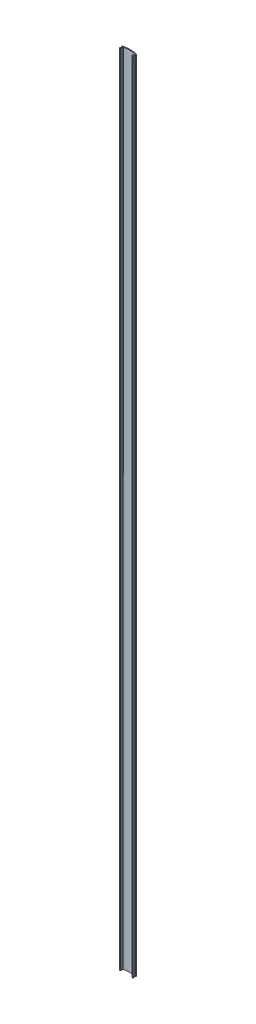
ISO-10303-21;
HEADER;
FILE_DESCRIPTION(('STEP AP214'),'2;1');
FILE_NAME('part.step','',(''),(''),'','','');
FILE_SCHEMA(('AUTOMOTIVE_DESIGN { 1 0 10303 214 1 1 1 1 }'));
ENDSEC;
DATA;
#1=APPLICATION_CONTEXT('core data for automotive mechanical design processes');
#2=APPLICATION_PROTOCOL_DEFINITION('international standard','automotive_design',2000,#1);
#3=PRODUCT_CONTEXT('',#1,'mechanical');
#4=PRODUCT('Part','Part','',(#3));
#5=PRODUCT_RELATED_PRODUCT_CATEGORY('part','',(#4));
#6=PRODUCT_DEFINITION_FORMATION('','',#4);
#7=PRODUCT_DEFINITION_CONTEXT('part definition',#1,'design');
#8=PRODUCT_DEFINITION('design','',#6,#7);
#9=PRODUCT_DEFINITION_SHAPE('','',#8);
#10=(LENGTH_UNIT() NAMED_UNIT(*) SI_UNIT(.MILLI.,.METRE.));
#11=(NAMED_UNIT(*) PLANE_ANGLE_UNIT() SI_UNIT($,.RADIAN.));
#12=(NAMED_UNIT(*) SI_UNIT($,.STERADIAN.) SOLID_ANGLE_UNIT());
#13=UNCERTAINTY_MEASURE_WITH_UNIT(LENGTH_MEASURE(1.E-05),#10,'distance_accuracy_value','');
#14=(GEOMETRIC_REPRESENTATION_CONTEXT(3) GLOBAL_UNCERTAINTY_ASSIGNED_CONTEXT((#13)) GLOBAL_UNIT_ASSIGNED_CONTEXT((#10,
#11,#12)) REPRESENTATION_CONTEXT('',''));
#15=CARTESIAN_POINT('',(0.,0.,0.));
#16=DIRECTION('',(0.,0.,1.));
#17=DIRECTION('',(1.,0.,0.));
#18=AXIS2_PLACEMENT_3D('',#15,#16,#17);
#19=CARTESIAN_POINT('',(-27.5846189597314,920.,-1.06516589667228));
#20=DIRECTION('',(0.,-1.,0.));
#21=DIRECTION('',(0.,0.,-1.));
#22=AXIS2_PLACEMENT_3D('',#19,#20,#21);
#23=CYLINDRICAL_SURFACE('',#22,0.299999999999996);
#24=CARTESIAN_POINT('',(-27.5846189597314,0.,-1.06516589667228));
#25=DIRECTION('',(0.,1.,0.));
#26=DIRECTION('',(0.,0.,1.));
#27=AXIS2_PLACEMENT_3D('',#24,#25,#26);
#28=CIRCLE('',#27,0.299999999999996);
#29=CARTESIAN_POINT('',(-27.8844231170864,0.,-1.05432766652717));
#30=VERTEX_POINT('',#29);
#31=CARTESIAN_POINT('',(-27.6471873404078,0.,-1.35856868762617));
#32=VERTEX_POINT('',#31);
#33=EDGE_CURVE('E222',#30,#32,#28,.F.);
#34=ORIENTED_EDGE('',*,*,#33,.F.);
#35=DIRECTION('',(0.,-1.,0.));
#36=VECTOR('',#35,1.);
#37=CARTESIAN_POINT('',(-27.8844231170864,920.,-1.05432766652717));
#38=LINE('',#37,#36);
#39=CARTESIAN_POINT('',(-27.8844231170864,920.,-1.05432766652717));
#40=VERTEX_POINT('',#39);
#41=EDGE_CURVE('E11',#40,#30,#38,.T.);
#42=ORIENTED_EDGE('',*,*,#41,.F.);
#43=CARTESIAN_POINT('',(-27.5846189597314,920.,-1.06516589667228));
#44=DIRECTION('',(0.,1.,0.));
#45=DIRECTION('',(0.,0.,1.));
#46=AXIS2_PLACEMENT_3D('',#43,#44,#45);
#47=CIRCLE('',#46,0.299999999999996);
#48=CARTESIAN_POINT('',(-27.6471873404078,920.,-1.35856868762617));
#49=VERTEX_POINT('',#48);
#50=EDGE_CURVE('E283',#40,#49,#47,.F.);
#51=ORIENTED_EDGE('',*,*,#50,.T.);
#52=DIRECTION('',(0.,-1.,0.));
#53=VECTOR('',#52,1.);
#54=CARTESIAN_POINT('',(-27.6471873404078,920.,-1.35856868762617));
#55=LINE('',#54,#53);
#56=EDGE_CURVE('E133',#49,#32,#55,.T.);
#57=ORIENTED_EDGE('',*,*,#56,.T.);
#58=EDGE_LOOP('',(#34,#42,#51,#57));
#59=FACE_BOUND('',#58,.T.);
#60=ADVANCED_FACE('F34',(#59),#23,.T.);
#61=CARTESIAN_POINT('',(-27.1597461180904,920.,-1.08052548901662));
#62=DIRECTION('',(0.,-1.,0.));
#63=DIRECTION('',(0.,0.,-1.));
#64=AXIS2_PLACEMENT_3D('',#61,#62,#63);
#65=CYLINDRICAL_SURFACE('',#64,0.725150383559832);
#66=CARTESIAN_POINT('',(-27.1597461180904,0.,-1.08052548901662));
#67=DIRECTION('',(0.,1.,0.));
#68=DIRECTION('',(0.,0.,1.));
#69=AXIS2_PLACEMENT_3D('',#66,#67,#68);
#70=CIRCLE('',#69,0.725150383559832);
#71=CARTESIAN_POINT('',(-27.263686116073,0.,-0.362862925135548));
#72=VERTEX_POINT('',#71);
#73=EDGE_CURVE('E225',#72,#30,#70,.F.);
#74=ORIENTED_EDGE('',*,*,#73,.F.);
#75=DIRECTION('',(0.,-1.,0.));
#76=VECTOR('',#75,1.);
#77=CARTESIAN_POINT('',(-27.263686116073,920.,-0.362862925135548));
#78=LINE('',#77,#76);
#79=CARTESIAN_POINT('',(-27.263686116073,920.,-0.362862925135548));
#80=VERTEX_POINT('',#79);
#81=EDGE_CURVE('E42',#80,#72,#78,.T.);
#82=ORIENTED_EDGE('',*,*,#81,.F.);
#83=CARTESIAN_POINT('',(-27.1597461180904,920.,-1.08052548901662));
#84=DIRECTION('',(0.,1.,0.));
#85=DIRECTION('',(0.,0.,1.));
#86=AXIS2_PLACEMENT_3D('',#83,#84,#85);
#87=CIRCLE('',#86,0.725150383559832);
#88=EDGE_CURVE('E343',#80,#40,#87,.F.);
#89=ORIENTED_EDGE('',*,*,#88,.T.);
#90=ORIENTED_EDGE('',*,*,#41,.T.);
#91=EDGE_LOOP('',(#74,#82,#89,#90));
#92=FACE_BOUND('',#91,.T.);
#93=ADVANCED_FACE('F342',(#92),#65,.T.);
#94=CARTESIAN_POINT('',(-27.3001584340567,920.,-0.111036700940236));
#95=DIRECTION('',(0.,-1.,0.));
#96=DIRECTION('',(0.,0.,-1.));
#97=AXIS2_PLACEMENT_3D('',#94,#95,#96);
#98=CYLINDRICAL_SURFACE('',#97,0.254453683745326);
#99=CARTESIAN_POINT('',(-27.3001584340567,0.,-0.111036700940236));
#100=DIRECTION('',(0.,1.,0.));
#101=DIRECTION('',(0.,0.,1.));
#102=AXIS2_PLACEMENT_3D('',#99,#100,#101);
#103=CIRCLE('',#102,0.254453683745326);
#104=CARTESIAN_POINT('',(-27.0457047503114,0.,-0.111036700940236));
#105=VERTEX_POINT('',#104);
#106=EDGE_CURVE('E228',#72,#105,#103,.F.);
#107=ORIENTED_EDGE('',*,*,#106,.T.);
#108=DIRECTION('',(0.,-1.,0.));
#109=VECTOR('',#108,1.);
#110=CARTESIAN_POINT('',(-27.0457047503114,920.,-0.111036700940236));
#111=LINE('',#110,#109);
#112=CARTESIAN_POINT('',(-27.0457047503114,920.,-0.111036700940236));
#113=VERTEX_POINT('',#112);
#114=EDGE_CURVE('E326',#113,#105,#111,.T.);
#115=ORIENTED_EDGE('',*,*,#114,.F.);
#116=CARTESIAN_POINT('',(-27.3001584340567,920.,-0.111036700940236));
#117=DIRECTION('',(0.,1.,0.));
#118=DIRECTION('',(0.,0.,1.));
#119=AXIS2_PLACEMENT_3D('',#116,#117,#118);
#120=CIRCLE('',#119,0.254453683745326);
#121=EDGE_CURVE('E333',#80,#113,#120,.F.);
#122=ORIENTED_EDGE('',*,*,#121,.F.);
#123=ORIENTED_EDGE('',*,*,#81,.T.);
#124=EDGE_LOOP('',(#107,#115,#122,#123));
#125=FACE_BOUND('',#124,.T.);
#126=ADVANCED_FACE('F331',(#125),#98,.F.);
#127=CARTESIAN_POINT('',(-27.0457047503114,920.,0.));
#128=DIRECTION('',(1.,0.,0.));
#129=DIRECTION('',(0.,0.,-1.));
#130=AXIS2_PLACEMENT_3D('',#127,#128,#129);
#131=PLANE('',#130);
#132=DIRECTION('',(0.,0.,1.));
#133=VECTOR('',#132,1.);
#134=CARTESIAN_POINT('',(-27.0457047503114,0.,0.));
#135=LINE('',#134,#133);
#136=CARTESIAN_POINT('',(-27.0457047503114,0.,0.970985399809798));
#137=VERTEX_POINT('',#136);
#138=EDGE_CURVE('E230',#105,#137,#135,.T.);
#139=ORIENTED_EDGE('',*,*,#138,.T.);
#140=DIRECTION('',(0.,-1.,0.));
#141=VECTOR('',#140,1.);
#142=CARTESIAN_POINT('',(-27.0457047503114,920.,0.970985399809798));
#143=LINE('',#142,#141);
#144=CARTESIAN_POINT('',(-27.0457047503114,920.,0.970985399809798));
#145=VERTEX_POINT('',#144);
#146=EDGE_CURVE('E323',#145,#137,#143,.T.);
#147=ORIENTED_EDGE('',*,*,#146,.F.);
#148=DIRECTION('',(0.,0.,1.));
#149=VECTOR('',#148,1.);
#150=CARTESIAN_POINT('',(-27.0457047503114,920.,0.));
#151=LINE('',#150,#149);
#152=EDGE_CURVE('E351',#113,#145,#151,.T.);
#153=ORIENTED_EDGE('',*,*,#152,.F.);
#154=ORIENTED_EDGE('',*,*,#114,.T.);
#155=EDGE_LOOP('',(#139,#147,#153,#154));
#156=FACE_BOUND('',#155,.T.);
#157=ADVANCED_FACE('F466',(#156),#131,.F.);
#158=CARTESIAN_POINT('',(-27.3001584340567,920.,0.970985399809798));
#159=DIRECTION('',(0.,-1.,0.));
#160=DIRECTION('',(0.,0.,-1.));
#161=AXIS2_PLACEMENT_3D('',#158,#159,#160);
#162=CYLINDRICAL_SURFACE('',#161,0.254453683745326);
#163=CARTESIAN_POINT('',(-27.3001584340567,0.,0.970985399809798));
#164=DIRECTION('',(0.,1.,0.));
#165=DIRECTION('',(0.,0.,1.));
#166=AXIS2_PLACEMENT_3D('',#163,#164,#165);
#167=CIRCLE('',#166,0.254453683745326);
#168=CARTESIAN_POINT('',(-27.260665215533,0.,1.22235557079715));
#169=VERTEX_POINT('',#168);
#170=EDGE_CURVE('E232',#137,#169,#167,.F.);
#171=ORIENTED_EDGE('',*,*,#170,.T.);
#172=DIRECTION('',(0.,-1.,0.));
#173=VECTOR('',#172,1.);
#174=CARTESIAN_POINT('',(-27.260665215533,920.,1.22235557079715));
#175=LINE('',#174,#173);
#176=CARTESIAN_POINT('',(-27.260665215533,920.,1.22235557079715));
#177=VERTEX_POINT('',#176);
#178=EDGE_CURVE('E320',#177,#169,#175,.T.);
#179=ORIENTED_EDGE('',*,*,#178,.F.);
#180=CARTESIAN_POINT('',(-27.3001584340567,920.,0.970985399809798));
#181=DIRECTION('',(0.,1.,0.));
#182=DIRECTION('',(0.,0.,1.));
#183=AXIS2_PLACEMENT_3D('',#180,#181,#182);
#184=CIRCLE('',#183,0.254453683745326);
#185=EDGE_CURVE('E353',#145,#177,#184,.F.);
#186=ORIENTED_EDGE('',*,*,#185,.F.);
#187=ORIENTED_EDGE('',*,*,#146,.T.);
#188=EDGE_LOOP('',(#171,#179,#186,#187));
#189=FACE_BOUND('',#188,.T.);
#190=ADVANCED_FACE('F461',(#189),#162,.F.);
#191=CARTESIAN_POINT('',(-27.183170486753,920.,1.71560134696434));
#192=DIRECTION('',(0.,-1.,0.));
#193=DIRECTION('',(0.,0.,-1.));
#194=AXIS2_PLACEMENT_3D('',#191,#192,#193);
#195=CYLINDRICAL_SURFACE('',#194,0.499296333548983);
#196=CARTESIAN_POINT('',(-27.183170486753,0.,1.71560134696434));
#197=DIRECTION('',(0.,1.,0.));
#198=DIRECTION('',(0.,0.,1.));
#199=AXIS2_PLACEMENT_3D('',#196,#197,#198);
#200=CIRCLE('',#199,0.499296333548983);
#201=CARTESIAN_POINT('',(-27.0709170540074,0.,2.20211547371944));
#202=VERTEX_POINT('',#201);
#203=EDGE_CURVE('E234',#169,#202,#200,.T.);
#204=ORIENTED_EDGE('',*,*,#203,.T.);
#205=DIRECTION('',(0.,-1.,0.));
#206=VECTOR('',#205,1.);
#207=CARTESIAN_POINT('',(-27.0709170540074,920.,2.20211547371944));
#208=LINE('',#207,#206);
#209=CARTESIAN_POINT('',(-27.0709170540074,920.,2.20211547371944));
#210=VERTEX_POINT('',#209);
#211=EDGE_CURVE('E317',#210,#202,#208,.T.);
#212=ORIENTED_EDGE('',*,*,#211,.F.);
#213=CARTESIAN_POINT('',(-27.183170486753,920.,1.71560134696434));
#214=DIRECTION('',(0.,1.,0.));
#215=DIRECTION('',(0.,0.,1.));
#216=AXIS2_PLACEMENT_3D('',#213,#214,#215);
#217=CIRCLE('',#216,0.499296333548983);
#218=EDGE_CURVE('E355',#177,#210,#217,.T.);
#219=ORIENTED_EDGE('',*,*,#218,.F.);
#220=ORIENTED_EDGE('',*,*,#178,.T.);
#221=EDGE_LOOP('',(#204,#212,#219,#220));
#222=FACE_BOUND('',#221,.T.);
#223=ADVANCED_FACE('F458',(#222),#195,.T.);
#224=CARTESIAN_POINT('',(0.,920.,2.20211547371944));
#225=DIRECTION('',(0.,0.,-1.));
#226=DIRECTION('',(-1.,0.,0.));
#227=AXIS2_PLACEMENT_3D('',#224,#225,#226);
#228=PLANE('',#227);
#229=DIRECTION('',(1.,0.,0.));
#230=VECTOR('',#229,1.);
#231=CARTESIAN_POINT('',(0.,0.,2.20211547371944));
#232=LINE('',#231,#230);
#233=CARTESIAN_POINT('',(-26.3857047503113,0.,2.20211547371944));
#234=VERTEX_POINT('',#233);
#235=EDGE_CURVE('E236',#202,#234,#232,.T.);
#236=ORIENTED_EDGE('',*,*,#235,.T.);
#237=DIRECTION('',(0.,-1.,0.));
#238=VECTOR('',#237,1.);
#239=CARTESIAN_POINT('',(-26.3857047503113,920.,2.20211547371944));
#240=LINE('',#239,#238);
#241=CARTESIAN_POINT('',(-26.3857047503113,920.,2.20211547371944));
#242=VERTEX_POINT('',#241);
#243=EDGE_CURVE('E315',#242,#234,#240,.T.);
#244=ORIENTED_EDGE('',*,*,#243,.F.);
#245=DIRECTION('',(1.,0.,0.));
#246=VECTOR('',#245,1.);
#247=CARTESIAN_POINT('',(0.,920.,2.20211547371944));
#248=LINE('',#247,#246);
#249=EDGE_CURVE('E357',#210,#242,#248,.T.);
#250=ORIENTED_EDGE('',*,*,#249,.F.);
#251=ORIENTED_EDGE('',*,*,#211,.T.);
#252=EDGE_LOOP('',(#236,#244,#250,#251));
#253=FACE_BOUND('',#252,.T.);
#254=ADVANCED_FACE('F454',(#253),#228,.F.);
#255=CARTESIAN_POINT('',(-26.3857047503113,920.,1.90211547371944));
#256=DIRECTION('',(0.,-1.,0.));
#257=DIRECTION('',(0.,0.,-1.));
#258=AXIS2_PLACEMENT_3D('',#255,#256,#257);
#259=CYLINDRICAL_SURFACE('',#258,0.300000000000003);
#260=CARTESIAN_POINT('',(-26.3857047503113,0.,1.90211547371944));
#261=DIRECTION('',(0.,1.,0.));
#262=DIRECTION('',(0.,0.,1.));
#263=AXIS2_PLACEMENT_3D('',#260,#261,#262);
#264=CIRCLE('',#263,0.300000000000003);
#265=CARTESIAN_POINT('',(-26.0857047503113,0.,1.90211547371944));
#266=VERTEX_POINT('',#265);
#267=EDGE_CURVE('E239',#266,#234,#264,.F.);
#268=ORIENTED_EDGE('',*,*,#267,.F.);
#269=DIRECTION('',(0.,-1.,0.));
#270=VECTOR('',#269,1.);
#271=CARTESIAN_POINT('',(-26.0857047503113,920.,1.90211547371944));
#272=LINE('',#271,#270);
#273=CARTESIAN_POINT('',(-26.0857047503113,920.,1.90211547371944));
#274=VERTEX_POINT('',#273);
#275=EDGE_CURVE('E313',#274,#266,#272,.T.);
#276=ORIENTED_EDGE('',*,*,#275,.F.);
#277=CARTESIAN_POINT('',(-26.3857047503113,920.,1.90211547371944));
#278=DIRECTION('',(0.,1.,0.));
#279=DIRECTION('',(0.,0.,1.));
#280=AXIS2_PLACEMENT_3D('',#277,#278,#279);
#281=CIRCLE('',#280,0.300000000000003);
#282=EDGE_CURVE('E359',#274,#242,#281,.F.);
#283=ORIENTED_EDGE('',*,*,#282,.T.);
#284=ORIENTED_EDGE('',*,*,#243,.T.);
#285=EDGE_LOOP('',(#268,#276,#283,#284));
#286=FACE_BOUND('',#285,.T.);
#287=ADVANCED_FACE('F449',(#286),#259,.T.);
#288=CARTESIAN_POINT('',(-26.0857047503113,920.,0.));
#289=DIRECTION('',(1.,0.,0.));
#290=DIRECTION('',(0.,0.,-1.));
#291=AXIS2_PLACEMENT_3D('',#288,#289,#290);
#292=PLANE('',#291);
#293=DIRECTION('',(0.,0.,1.));
#294=VECTOR('',#293,1.);
#295=CARTESIAN_POINT('',(-26.0857047503113,0.,0.));
#296=LINE('',#295,#294);
#297=CARTESIAN_POINT('',(-26.0857047503113,0.,-0.111036700940236));
#298=VERTEX_POINT('',#297);
#299=EDGE_CURVE('E242',#298,#266,#296,.T.);
#300=ORIENTED_EDGE('',*,*,#299,.F.);
#301=DIRECTION('',(0.,-1.,0.));
#302=VECTOR('',#301,1.);
#303=CARTESIAN_POINT('',(-26.0857047503113,920.,-0.111036700940236));
#304=LINE('',#303,#302);
#305=CARTESIAN_POINT('',(-26.0857047503113,920.,-0.111036700940236));
#306=VERTEX_POINT('',#305);
#307=EDGE_CURVE('E311',#306,#298,#304,.T.);
#308=ORIENTED_EDGE('',*,*,#307,.F.);
#309=DIRECTION('',(0.,0.,1.));
#310=VECTOR('',#309,1.);
#311=CARTESIAN_POINT('',(-26.0857047503113,920.,0.));
#312=LINE('',#311,#310);
#313=EDGE_CURVE('E362',#306,#274,#312,.T.);
#314=ORIENTED_EDGE('',*,*,#313,.T.);
#315=ORIENTED_EDGE('',*,*,#275,.T.);
#316=EDGE_LOOP('',(#300,#308,#314,#315));
#317=FACE_BOUND('',#316,.T.);
#318=ADVANCED_FACE('F444',(#317),#292,.T.);
#319=CARTESIAN_POINT('',(-27.3001584340567,920.,-0.111036700940236));
#320=DIRECTION('',(0.,-1.,0.));
#321=DIRECTION('',(0.,0.,-1.));
#322=AXIS2_PLACEMENT_3D('',#319,#320,#321);
#323=CYLINDRICAL_SURFACE('',#322,1.21445368374537);
#324=CARTESIAN_POINT('',(-27.3001584340567,0.,-0.111036700940236));
#325=DIRECTION('',(0.,1.,0.));
#326=DIRECTION('',(0.,0.,1.));
#327=AXIS2_PLACEMENT_3D('',#324,#325,#326);
#328=CIRCLE('',#327,1.21445368374537);
#329=CARTESIAN_POINT('',(-26.112204160698,0.,-0.363350779761874));
#330=VERTEX_POINT('',#329);
#331=EDGE_CURVE('E245',#330,#298,#328,.F.);
#332=ORIENTED_EDGE('',*,*,#331,.F.);
#333=DIRECTION('',(0.,-1.,0.));
#334=VECTOR('',#333,1.);
#335=CARTESIAN_POINT('',(-26.112204160698,920.,-0.363350779761874));
#336=LINE('',#335,#334);
#337=CARTESIAN_POINT('',(-26.112204160698,920.,-0.363350779761874));
#338=VERTEX_POINT('',#337);
#339=EDGE_CURVE('E309',#338,#330,#336,.T.);
#340=ORIENTED_EDGE('',*,*,#339,.F.);
#341=CARTESIAN_POINT('',(-27.3001584340567,920.,-0.111036700940236));
#342=DIRECTION('',(0.,1.,0.));
#343=DIRECTION('',(0.,0.,1.));
#344=AXIS2_PLACEMENT_3D('',#341,#342,#343);
#345=CIRCLE('',#344,1.21445368374537);
#346=EDGE_CURVE('E365',#338,#306,#345,.F.);
#347=ORIENTED_EDGE('',*,*,#346,.T.);
#348=ORIENTED_EDGE('',*,*,#307,.T.);
#349=EDGE_LOOP('',(#332,#340,#347,#348));
#350=FACE_BOUND('',#349,.T.);
#351=ADVANCED_FACE('F438',(#350),#323,.T.);
#352=CARTESIAN_POINT('',(-25.8187501683576,920.,-0.42567857756891));
#353=DIRECTION('',(0.,-1.,0.));
#354=DIRECTION('',(0.,0.,-1.));
#355=AXIS2_PLACEMENT_3D('',#352,#353,#354);
#356=CYLINDRICAL_SURFACE('',#355,0.3);
#357=CARTESIAN_POINT('',(-25.8187501683576,0.,-0.42567857756891));
#358=DIRECTION('',(0.,1.,0.));
#359=DIRECTION('',(0.,0.,1.));
#360=AXIS2_PLACEMENT_3D('',#357,#358,#359);
#361=CIRCLE('',#360,0.3);
#362=CARTESIAN_POINT('',(-25.8688533523757,0.,-0.721465106929612));
#363=VERTEX_POINT('',#362);
#364=EDGE_CURVE('E248',#330,#363,#361,.F.);
#365=ORIENTED_EDGE('',*,*,#364,.T.);
#366=DIRECTION('',(0.,-1.,0.));
#367=VECTOR('',#366,1.);
#368=CARTESIAN_POINT('',(-25.8688533523757,920.,-0.721465106929612));
#369=LINE('',#368,#367);
#370=CARTESIAN_POINT('',(-25.8688533523757,920.,-0.721465106929612));
#371=VERTEX_POINT('',#370);
#372=EDGE_CURVE('E307',#371,#363,#369,.T.);
#373=ORIENTED_EDGE('',*,*,#372,.F.);
#374=CARTESIAN_POINT('',(-25.8187501683576,920.,-0.42567857756891));
#375=DIRECTION('',(0.,1.,0.));
#376=DIRECTION('',(0.,0.,1.));
#377=AXIS2_PLACEMENT_3D('',#374,#375,#376);
#378=CIRCLE('',#377,0.3);
#379=EDGE_CURVE('E368',#338,#371,#378,.F.);
#380=ORIENTED_EDGE('',*,*,#379,.F.);
#381=ORIENTED_EDGE('',*,*,#339,.T.);
#382=EDGE_LOOP('',(#365,#373,#380,#381));
#383=FACE_BOUND('',#382,.T.);
#384=ADVANCED_FACE('F467',(#383),#356,.F.);
#385=CARTESIAN_POINT('',(-19.5257047503116,920.,25.4179127137949));
#386=DIRECTION('',(0.,-1.,0.));
#387=DIRECTION('',(0.,0.,-1.));
#388=AXIS2_PLACEMENT_3D('',#385,#386,#387);
#389=CYLINDRICAL_SURFACE('',#388,26.8980037743036);
#390=CARTESIAN_POINT('',(-19.5257047503116,0.,25.4179127137949));
#391=DIRECTION('',(0.,1.,0.));
#392=DIRECTION('',(0.,0.,1.));
#393=AXIS2_PLACEMENT_3D('',#390,#391,#392);
#394=CIRCLE('',#393,26.8980037743036);
#395=CARTESIAN_POINT('',(-13.182556148247,0.,-0.721465106929491));
#396=VERTEX_POINT('',#395);
#397=EDGE_CURVE('E251',#396,#363,#394,.T.);
#398=ORIENTED_EDGE('',*,*,#397,.F.);
#399=DIRECTION('',(0.,-1.,0.));
#400=VECTOR('',#399,1.);
#401=CARTESIAN_POINT('',(-13.182556148247,920.,-0.721465106929491));
#402=LINE('',#401,#400);
#403=CARTESIAN_POINT('',(-13.182556148247,920.,-0.721465106929491));
#404=VERTEX_POINT('',#403);
#405=EDGE_CURVE('E305',#404,#396,#402,.T.);
#406=ORIENTED_EDGE('',*,*,#405,.F.);
#407=CARTESIAN_POINT('',(-19.5257047503116,920.,25.4179127137949));
#408=DIRECTION('',(0.,1.,0.));
#409=DIRECTION('',(0.,0.,1.));
#410=AXIS2_PLACEMENT_3D('',#407,#408,#409);
#411=CIRCLE('',#410,26.8980037743036);
#412=EDGE_CURVE('E370',#404,#371,#411,.T.);
#413=ORIENTED_EDGE('',*,*,#412,.T.);
#414=ORIENTED_EDGE('',*,*,#372,.T.);
#415=EDGE_LOOP('',(#398,#406,#413,#414));
#416=FACE_BOUND('',#415,.T.);
#417=ADVANCED_FACE('F432',(#416),#389,.F.);
#418=CARTESIAN_POINT('',(-13.2326593322661,920.,-0.425678577568995));
#419=DIRECTION('',(0.,-1.,0.));
#420=DIRECTION('',(0.,0.,-1.));
#421=AXIS2_PLACEMENT_3D('',#418,#419,#420);
#422=CYLINDRICAL_SURFACE('',#421,0.299999999999982);
#423=CARTESIAN_POINT('',(-13.2326593322661,0.,-0.425678577568995));
#424=DIRECTION('',(0.,1.,0.));
#425=DIRECTION('',(0.,0.,1.));
#426=AXIS2_PLACEMENT_3D('',#423,#424,#425);
#427=CIRCLE('',#426,0.299999999999982);
#428=CARTESIAN_POINT('',(-12.9392053399257,0.,-0.363350779761997));
#429=VERTEX_POINT('',#428);
#430=EDGE_CURVE('E254',#429,#396,#427,.T.);
#431=ORIENTED_EDGE('',*,*,#430,.F.);
#432=DIRECTION('',(0.,-1.,0.));
#433=VECTOR('',#432,1.);
#434=CARTESIAN_POINT('',(-12.9392053399257,920.,-0.363350779761997));
#435=LINE('',#434,#433);
#436=CARTESIAN_POINT('',(-12.9392053399257,920.,-0.363350779761997));
#437=VERTEX_POINT('',#436);
#438=EDGE_CURVE('E303',#437,#429,#435,.T.);
#439=ORIENTED_EDGE('',*,*,#438,.F.);
#440=CARTESIAN_POINT('',(-13.2326593322661,920.,-0.425678577568995));
#441=DIRECTION('',(0.,1.,0.));
#442=DIRECTION('',(0.,0.,1.));
#443=AXIS2_PLACEMENT_3D('',#440,#441,#442);
#444=CIRCLE('',#443,0.299999999999982);
#445=EDGE_CURVE('E373',#437,#404,#444,.T.);
#446=ORIENTED_EDGE('',*,*,#445,.T.);
#447=ORIENTED_EDGE('',*,*,#405,.T.);
#448=EDGE_LOOP('',(#431,#439,#446,#447));
#449=FACE_BOUND('',#448,.T.);
#450=ADVANCED_FACE('F426',(#449),#422,.F.);
#451=CARTESIAN_POINT('',(-11.751251066567,920.,-0.11103670094036));
#452=DIRECTION('',(0.,-1.,0.));
#453=DIRECTION('',(0.,0.,-1.));
#454=AXIS2_PLACEMENT_3D('',#451,#452,#453);
#455=CYLINDRICAL_SURFACE('',#454,1.21445368374535);
#456=CARTESIAN_POINT('',(-11.751251066567,0.,-0.11103670094036));
#457=DIRECTION('',(0.,1.,0.));
#458=DIRECTION('',(0.,0.,1.));
#459=AXIS2_PLACEMENT_3D('',#456,#457,#458);
#460=CIRCLE('',#459,1.21445368374535);
#461=CARTESIAN_POINT('',(-12.9657047503124,0.,-0.111036700940365));
#462=VERTEX_POINT('',#461);
#463=EDGE_CURVE('E257',#429,#462,#460,.T.);
#464=ORIENTED_EDGE('',*,*,#463,.T.);
#465=DIRECTION('',(0.,-1.,0.));
#466=VECTOR('',#465,1.);
#467=CARTESIAN_POINT('',(-12.9657047503124,920.,-0.111036700940365));
#468=LINE('',#467,#466);
#469=CARTESIAN_POINT('',(-12.9657047503124,920.,-0.111036700940365));
#470=VERTEX_POINT('',#469);
#471=EDGE_CURVE('E300',#470,#462,#468,.T.);
#472=ORIENTED_EDGE('',*,*,#471,.F.);
#473=CARTESIAN_POINT('',(-11.751251066567,920.,-0.11103670094036));
#474=DIRECTION('',(0.,1.,0.));
#475=DIRECTION('',(0.,0.,1.));
#476=AXIS2_PLACEMENT_3D('',#473,#474,#475);
#477=CIRCLE('',#476,1.21445368374535);
#478=EDGE_CURVE('E376',#437,#470,#477,.T.);
#479=ORIENTED_EDGE('',*,*,#478,.F.);
#480=ORIENTED_EDGE('',*,*,#438,.T.);
#481=EDGE_LOOP('',(#464,#472,#479,#480));
#482=FACE_BOUND('',#481,.T.);
#483=ADVANCED_FACE('F523',(#482),#455,.T.);
#484=CARTESIAN_POINT('',(-12.9657047503124,920.,0.));
#485=DIRECTION('',(1.,0.,0.));
#486=DIRECTION('',(0.,0.,-1.));
#487=AXIS2_PLACEMENT_3D('',#484,#485,#486);
#488=PLANE('',#487);
#489=DIRECTION('',(0.,0.,1.));
#490=VECTOR('',#489,1.);
#491=CARTESIAN_POINT('',(-12.9657047503124,0.,0.));
#492=LINE('',#491,#490);
#493=CARTESIAN_POINT('',(-12.9657047503124,0.,1.90211547371931));
#494=VERTEX_POINT('',#493);
#495=EDGE_CURVE('E259',#462,#494,#492,.T.);
#496=ORIENTED_EDGE('',*,*,#495,.T.);
#497=DIRECTION('',(0.,-1.,0.));
#498=VECTOR('',#497,1.);
#499=CARTESIAN_POINT('',(-12.9657047503124,920.,1.90211547371931));
#500=LINE('',#499,#498);
#501=CARTESIAN_POINT('',(-12.9657047503124,920.,1.90211547371931));
#502=VERTEX_POINT('',#501);
#503=EDGE_CURVE('E297',#502,#494,#500,.T.);
#504=ORIENTED_EDGE('',*,*,#503,.F.);
#505=DIRECTION('',(0.,0.,1.));
#506=VECTOR('',#505,1.);
#507=CARTESIAN_POINT('',(-12.9657047503124,920.,0.));
#508=LINE('',#507,#506);
#509=EDGE_CURVE('E378',#470,#502,#508,.T.);
#510=ORIENTED_EDGE('',*,*,#509,.F.);
#511=ORIENTED_EDGE('',*,*,#471,.T.);
#512=EDGE_LOOP('',(#496,#504,#510,#511));
#513=FACE_BOUND('',#512,.T.);
#514=ADVANCED_FACE('F420',(#513),#488,.F.);
#515=CARTESIAN_POINT('',(-12.6657047503124,920.,1.90211547371931));
#516=DIRECTION('',(0.,-1.,0.));
#517=DIRECTION('',(0.,0.,-1.));
#518=AXIS2_PLACEMENT_3D('',#515,#516,#517);
#519=CYLINDRICAL_SURFACE('',#518,0.300000000000001);
#520=CARTESIAN_POINT('',(-12.6657047503124,0.,1.90211547371931));
#521=DIRECTION('',(0.,1.,0.));
#522=DIRECTION('',(0.,0.,1.));
#523=AXIS2_PLACEMENT_3D('',#520,#521,#522);
#524=CIRCLE('',#523,0.300000000000001);
#525=CARTESIAN_POINT('',(-12.6657047503124,0.,2.20211547371931));
#526=VERTEX_POINT('',#525);
#527=EDGE_CURVE('E261',#494,#526,#524,.T.);
#528=ORIENTED_EDGE('',*,*,#527,.T.);
#529=DIRECTION('',(0.,-1.,0.));
#530=VECTOR('',#529,1.);
#531=CARTESIAN_POINT('',(-12.6657047503124,920.,2.20211547371931));
#532=LINE('',#531,#530);
#533=CARTESIAN_POINT('',(-12.6657047503124,920.,2.20211547371931));
#534=VERTEX_POINT('',#533);
#535=EDGE_CURVE('E295',#534,#526,#532,.T.);
#536=ORIENTED_EDGE('',*,*,#535,.F.);
#537=CARTESIAN_POINT('',(-12.6657047503124,920.,1.90211547371931));
#538=DIRECTION('',(0.,1.,0.));
#539=DIRECTION('',(0.,0.,1.));
#540=AXIS2_PLACEMENT_3D('',#537,#538,#539);
#541=CIRCLE('',#540,0.300000000000001);
#542=EDGE_CURVE('E380',#502,#534,#541,.T.);
#543=ORIENTED_EDGE('',*,*,#542,.F.);
#544=ORIENTED_EDGE('',*,*,#503,.T.);
#545=EDGE_LOOP('',(#528,#536,#543,#544));
#546=FACE_BOUND('',#545,.T.);
#547=ADVANCED_FACE('F416',(#546),#519,.T.);
#548=CARTESIAN_POINT('',(0.,920.,2.20211547371931));
#549=DIRECTION('',(0.,0.,1.));
#550=DIRECTION('',(1.,0.,0.));
#551=AXIS2_PLACEMENT_3D('',#548,#549,#550);
#552=PLANE('',#551);
#553=DIRECTION('',(-1.,0.,0.));
#554=VECTOR('',#553,1.);
#555=CARTESIAN_POINT('',(0.,0.,2.20211547371931));
#556=LINE('',#555,#554);
#557=CARTESIAN_POINT('',(-11.9804924466164,0.,2.20211547371931));
#558=VERTEX_POINT('',#557);
#559=EDGE_CURVE('E264',#558,#526,#556,.T.);
#560=ORIENTED_EDGE('',*,*,#559,.F.);
#561=DIRECTION('',(0.,-1.,0.));
#562=VECTOR('',#561,1.);
#563=CARTESIAN_POINT('',(-11.9804924466164,920.,2.20211547371931));
#564=LINE('',#563,#562);
#565=CARTESIAN_POINT('',(-11.9804924466164,920.,2.20211547371931));
#566=VERTEX_POINT('',#565);
#567=EDGE_CURVE('E293',#566,#558,#564,.T.);
#568=ORIENTED_EDGE('',*,*,#567,.F.);
#569=DIRECTION('',(-1.,0.,0.));
#570=VECTOR('',#569,1.);
#571=CARTESIAN_POINT('',(0.,920.,2.20211547371931));
#572=LINE('',#571,#570);
#573=EDGE_CURVE('E382',#566,#534,#572,.T.);
#574=ORIENTED_EDGE('',*,*,#573,.T.);
#575=ORIENTED_EDGE('',*,*,#535,.T.);
#576=EDGE_LOOP('',(#560,#568,#574,#575));
#577=FACE_BOUND('',#576,.T.);
#578=ADVANCED_FACE('F411',(#577),#552,.T.);
#579=CARTESIAN_POINT('',(-11.8682390138707,920.,1.71560134696421));
#580=DIRECTION('',(0.,-1.,0.));
#581=DIRECTION('',(0.,0.,-1.));
#582=AXIS2_PLACEMENT_3D('',#579,#580,#581);
#583=CYLINDRICAL_SURFACE('',#582,0.499296333548982);
#584=CARTESIAN_POINT('',(-11.8682390138707,0.,1.71560134696421));
#585=DIRECTION('',(0.,1.,0.));
#586=DIRECTION('',(0.,0.,1.));
#587=AXIS2_PLACEMENT_3D('',#584,#585,#586);
#588=CIRCLE('',#587,0.499296333548982);
#589=CARTESIAN_POINT('',(-11.7907442850908,0.,1.22235557079702));
#590=VERTEX_POINT('',#589);
#591=EDGE_CURVE('E267',#590,#558,#588,.F.);
#592=ORIENTED_EDGE('',*,*,#591,.F.);
#593=DIRECTION('',(0.,-1.,0.));
#594=VECTOR('',#593,1.);
#595=CARTESIAN_POINT('',(-11.7907442850908,920.,1.22235557079702));
#596=LINE('',#595,#594);
#597=CARTESIAN_POINT('',(-11.7907442850908,920.,1.22235557079702));
#598=VERTEX_POINT('',#597);
#599=EDGE_CURVE('E291',#598,#590,#596,.T.);
#600=ORIENTED_EDGE('',*,*,#599,.F.);
#601=CARTESIAN_POINT('',(-11.8682390138707,920.,1.71560134696421));
#602=DIRECTION('',(0.,1.,0.));
#603=DIRECTION('',(0.,0.,1.));
#604=AXIS2_PLACEMENT_3D('',#601,#602,#603);
#605=CIRCLE('',#604,0.499296333548982);
#606=EDGE_CURVE('E385',#598,#566,#605,.F.);
#607=ORIENTED_EDGE('',*,*,#606,.T.);
#608=ORIENTED_EDGE('',*,*,#567,.T.);
#609=EDGE_LOOP('',(#592,#600,#607,#608));
#610=FACE_BOUND('',#609,.T.);
#611=ADVANCED_FACE('F406',(#610),#583,.T.);
#612=CARTESIAN_POINT('',(-11.7512510665671,920.,0.97098539980967));
#613=DIRECTION('',(0.,-1.,0.));
#614=DIRECTION('',(0.,0.,-1.));
#615=AXIS2_PLACEMENT_3D('',#612,#613,#614);
#616=CYLINDRICAL_SURFACE('',#615,0.254453683745326);
#617=CARTESIAN_POINT('',(-11.7512510665671,0.,0.97098539980967));
#618=DIRECTION('',(0.,1.,0.));
#619=DIRECTION('',(0.,0.,1.));
#620=AXIS2_PLACEMENT_3D('',#617,#618,#619);
#621=CIRCLE('',#620,0.254453683745326);
#622=CARTESIAN_POINT('',(-12.0057047503124,0.,0.970985399809672));
#623=VERTEX_POINT('',#622);
#624=EDGE_CURVE('E270',#623,#590,#621,.T.);
#625=ORIENTED_EDGE('',*,*,#624,.F.);
#626=DIRECTION('',(0.,-1.,0.));
#627=VECTOR('',#626,1.);
#628=CARTESIAN_POINT('',(-12.0057047503124,920.,0.970985399809672));
#629=LINE('',#628,#627);
#630=CARTESIAN_POINT('',(-12.0057047503124,920.,0.970985399809672));
#631=VERTEX_POINT('',#630);
#632=EDGE_CURVE('E289',#631,#623,#629,.T.);
#633=ORIENTED_EDGE('',*,*,#632,.F.);
#634=CARTESIAN_POINT('',(-11.7512510665671,920.,0.97098539980967));
#635=DIRECTION('',(0.,1.,0.));
#636=DIRECTION('',(0.,0.,1.));
#637=AXIS2_PLACEMENT_3D('',#634,#635,#636);
#638=CIRCLE('',#637,0.254453683745326);
#639=EDGE_CURVE('E388',#631,#598,#638,.T.);
#640=ORIENTED_EDGE('',*,*,#639,.T.);
#641=ORIENTED_EDGE('',*,*,#599,.T.);
#642=EDGE_LOOP('',(#625,#633,#640,#641));
#643=FACE_BOUND('',#642,.T.);
#644=ADVANCED_FACE('F402',(#643),#616,.F.);
#645=CARTESIAN_POINT('',(-12.0057047503124,920.,0.));
#646=DIRECTION('',(1.,0.,0.));
#647=DIRECTION('',(0.,0.,-1.));
#648=AXIS2_PLACEMENT_3D('',#645,#646,#647);
#649=PLANE('',#648);
#650=DIRECTION('',(0.,0.,1.));
#651=VECTOR('',#650,1.);
#652=CARTESIAN_POINT('',(-12.0057047503124,0.,0.));
#653=LINE('',#652,#651);
#654=CARTESIAN_POINT('',(-12.0057047503124,0.,-0.111036700940362));
#655=VERTEX_POINT('',#654);
#656=EDGE_CURVE('E273',#655,#623,#653,.T.);
#657=ORIENTED_EDGE('',*,*,#656,.F.);
#658=DIRECTION('',(0.,-1.,0.));
#659=VECTOR('',#658,1.);
#660=CARTESIAN_POINT('',(-12.0057047503124,920.,-0.111036700940362));
#661=LINE('',#660,#659);
#662=CARTESIAN_POINT('',(-12.0057047503124,920.,-0.111036700940362));
#663=VERTEX_POINT('',#662);
#664=EDGE_CURVE('E287',#663,#655,#661,.T.);
#665=ORIENTED_EDGE('',*,*,#664,.F.);
#666=DIRECTION('',(0.,0.,1.));
#667=VECTOR('',#666,1.);
#668=CARTESIAN_POINT('',(-12.0057047503124,920.,0.));
#669=LINE('',#668,#667);
#670=EDGE_CURVE('E391',#663,#631,#669,.T.);
#671=ORIENTED_EDGE('',*,*,#670,.T.);
#672=ORIENTED_EDGE('',*,*,#632,.T.);
#673=EDGE_LOOP('',(#657,#665,#671,#672));
#674=FACE_BOUND('',#673,.T.);
#675=ADVANCED_FACE('F399',(#674),#649,.T.);
#676=CARTESIAN_POINT('',(-11.7512510665671,920.,-0.111036700940362));
#677=DIRECTION('',(0.,-1.,0.));
#678=DIRECTION('',(0.,0.,-1.));
#679=AXIS2_PLACEMENT_3D('',#676,#677,#678);
#680=CYLINDRICAL_SURFACE('',#679,0.254453683745326);
#681=CARTESIAN_POINT('',(-11.7512510665671,0.,-0.111036700940362));
#682=DIRECTION('',(0.,1.,0.));
#683=DIRECTION('',(0.,0.,1.));
#684=AXIS2_PLACEMENT_3D('',#681,#682,#683);
#685=CIRCLE('',#684,0.254453683745326);
#686=CARTESIAN_POINT('',(-11.7877233845507,0.,-0.36286292513567));
#687=VERTEX_POINT('',#686);
#688=EDGE_CURVE('E276',#687,#655,#685,.T.);
#689=ORIENTED_EDGE('',*,*,#688,.F.);
#690=DIRECTION('',(0.,-1.,0.));
#691=VECTOR('',#690,1.);
#692=CARTESIAN_POINT('',(-11.7877233845507,920.,-0.36286292513567));
#693=LINE('',#692,#691);
#694=CARTESIAN_POINT('',(-11.7877233845507,920.,-0.36286292513567));
#695=VERTEX_POINT('',#694);
#696=EDGE_CURVE('E214',#695,#687,#693,.T.);
#697=ORIENTED_EDGE('',*,*,#696,.F.);
#698=CARTESIAN_POINT('',(-11.7512510665671,920.,-0.111036700940362));
#699=DIRECTION('',(0.,1.,0.));
#700=DIRECTION('',(0.,0.,1.));
#701=AXIS2_PLACEMENT_3D('',#698,#699,#700);
#702=CIRCLE('',#701,0.254453683745326);
#703=EDGE_CURVE('E207',#695,#663,#702,.T.);
#704=ORIENTED_EDGE('',*,*,#703,.T.);
#705=ORIENTED_EDGE('',*,*,#664,.T.);
#706=EDGE_LOOP('',(#689,#697,#704,#705));
#707=FACE_BOUND('',#706,.T.);
#708=ADVANCED_FACE('F395',(#707),#680,.F.);
#709=CARTESIAN_POINT('',(-11.8916633825334,920.,-1.08052548901674));
#710=DIRECTION('',(0.,-1.,0.));
#711=DIRECTION('',(0.,0.,-1.));
#712=AXIS2_PLACEMENT_3D('',#709,#710,#711);
#713=CYLINDRICAL_SURFACE('',#712,0.725150383559834);
#714=CARTESIAN_POINT('',(-11.8916633825334,0.,-1.08052548901674));
#715=DIRECTION('',(0.,1.,0.));
#716=DIRECTION('',(0.,0.,1.));
#717=AXIS2_PLACEMENT_3D('',#714,#715,#716);
#718=CIRCLE('',#717,0.725150383559834);
#719=CARTESIAN_POINT('',(-11.1669863835374,0.,-1.05432766652729));
#720=VERTEX_POINT('',#719);
#721=EDGE_CURVE('E213',#687,#720,#718,.T.);
#722=ORIENTED_EDGE('',*,*,#721,.T.);
#723=DIRECTION('',(0.,-1.,0.));
#724=VECTOR('',#723,1.);
#725=CARTESIAN_POINT('',(-11.1669863835374,920.,-1.05432766652729));
#726=LINE('',#725,#724);
#727=CARTESIAN_POINT('',(-11.1669863835374,920.,-1.05432766652729));
#728=VERTEX_POINT('',#727);
#729=EDGE_CURVE('E210',#728,#720,#726,.T.);
#730=ORIENTED_EDGE('',*,*,#729,.F.);
#731=CARTESIAN_POINT('',(-11.8916633825334,920.,-1.08052548901674));
#732=DIRECTION('',(0.,1.,0.));
#733=DIRECTION('',(0.,0.,1.));
#734=AXIS2_PLACEMENT_3D('',#731,#732,#733);
#735=CIRCLE('',#734,0.725150383559834);
#736=EDGE_CURVE('E200',#695,#728,#735,.T.);
#737=ORIENTED_EDGE('',*,*,#736,.F.);
#738=ORIENTED_EDGE('',*,*,#696,.T.);
#739=EDGE_LOOP('',(#722,#730,#737,#738));
#740=FACE_BOUND('',#739,.T.);
#741=ADVANCED_FACE('F211',(#740),#713,.T.);
#742=CARTESIAN_POINT('',(-11.4667905408924,920.,-1.0651658966724));
#743=DIRECTION('',(0.,-1.,0.));
#744=DIRECTION('',(0.,0.,-1.));
#745=AXIS2_PLACEMENT_3D('',#742,#743,#744);
#746=CYLINDRICAL_SURFACE('',#745,0.3);
#747=CARTESIAN_POINT('',(-11.4667905408924,0.,-1.0651658966724));
#748=DIRECTION('',(0.,1.,0.));
#749=DIRECTION('',(0.,0.,1.));
#750=AXIS2_PLACEMENT_3D('',#747,#748,#749);
#751=CIRCLE('',#750,0.3);
#752=CARTESIAN_POINT('',(-11.4042221602159,0.,-1.35856868762629));
#753=VERTEX_POINT('',#752);
#754=EDGE_CURVE('E126',#720,#753,#751,.T.);
#755=ORIENTED_EDGE('',*,*,#754,.T.);
#756=DIRECTION('',(0.,-1.,0.));
#757=VECTOR('',#756,1.);
#758=CARTESIAN_POINT('',(-11.4042221602159,920.,-1.35856868762629));
#759=LINE('',#758,#757);
#760=CARTESIAN_POINT('',(-11.4042221602159,920.,-1.35856868762629));
#761=VERTEX_POINT('',#760);
#762=EDGE_CURVE('E215',#761,#753,#759,.T.);
#763=ORIENTED_EDGE('',*,*,#762,.F.);
#764=CARTESIAN_POINT('',(-11.4667905408924,920.,-1.0651658966724));
#765=DIRECTION('',(0.,1.,0.));
#766=DIRECTION('',(0.,0.,1.));
#767=AXIS2_PLACEMENT_3D('',#764,#765,#766);
#768=CIRCLE('',#767,0.3);
#769=EDGE_CURVE('E204',#728,#761,#768,.T.);
#770=ORIENTED_EDGE('',*,*,#769,.F.);
#771=ORIENTED_EDGE('',*,*,#729,.T.);
#772=EDGE_LOOP('',(#755,#763,#770,#771));
#773=FACE_BOUND('',#772,.T.);
#774=ADVANCED_FACE('F217',(#773),#746,.T.);
#775=CARTESIAN_POINT('',(-19.5257047503117,920.,28.5618299006336));
#776=DIRECTION('',(0.,-1.,0.));
#777=DIRECTION('',(0.,0.,-1.));
#778=AXIS2_PLACEMENT_3D('',#775,#776,#777);
#779=CYLINDRICAL_SURFACE('',#778,31.0030439012296);
#780=CARTESIAN_POINT('',(-19.5257047503117,0.,28.5618299006336));
#781=DIRECTION('',(0.,1.,0.));
#782=DIRECTION('',(0.,0.,1.));
#783=AXIS2_PLACEMENT_3D('',#780,#781,#782);
#784=CIRCLE('',#783,31.0030439012296);
#785=EDGE_CURVE('E281',#753,#32,#784,.T.);
#786=ORIENTED_EDGE('',*,*,#785,.T.);
#787=ORIENTED_EDGE('',*,*,#56,.F.);
#788=CARTESIAN_POINT('',(-19.5257047503117,920.,28.5618299006336));
#789=DIRECTION('',(0.,1.,0.));
#790=DIRECTION('',(0.,0.,1.));
#791=AXIS2_PLACEMENT_3D('',#788,#789,#790);
#792=CIRCLE('',#791,31.0030439012296);
#793=EDGE_CURVE('E50',#761,#49,#792,.T.);
#794=ORIENTED_EDGE('',*,*,#793,.F.);
#795=ORIENTED_EDGE('',*,*,#762,.T.);
#796=EDGE_LOOP('',(#786,#787,#794,#795));
#797=FACE_BOUND('',#796,.T.);
#798=ADVANCED_FACE('F346',(#797),#779,.T.);
#799=CARTESIAN_POINT('',(0.,920.,0.));
#800=DIRECTION('',(0.,1.,0.));
#801=DIRECTION('',(0.,0.,1.));
#802=AXIS2_PLACEMENT_3D('',#799,#800,#801);
#803=PLANE('',#802);
#804=ORIENTED_EDGE('',*,*,#50,.F.);
#805=ORIENTED_EDGE('',*,*,#88,.F.);
#806=ORIENTED_EDGE('',*,*,#121,.T.);
#807=ORIENTED_EDGE('',*,*,#152,.T.);
#808=ORIENTED_EDGE('',*,*,#185,.T.);
#809=ORIENTED_EDGE('',*,*,#218,.T.);
#810=ORIENTED_EDGE('',*,*,#249,.T.);
#811=ORIENTED_EDGE('',*,*,#282,.F.);
#812=ORIENTED_EDGE('',*,*,#313,.F.);
#813=ORIENTED_EDGE('',*,*,#346,.F.);
#814=ORIENTED_EDGE('',*,*,#379,.T.);
#815=ORIENTED_EDGE('',*,*,#412,.F.);
#816=ORIENTED_EDGE('',*,*,#445,.F.);
#817=ORIENTED_EDGE('',*,*,#478,.T.);
#818=ORIENTED_EDGE('',*,*,#509,.T.);
#819=ORIENTED_EDGE('',*,*,#542,.T.);
#820=ORIENTED_EDGE('',*,*,#573,.F.);
#821=ORIENTED_EDGE('',*,*,#606,.F.);
#822=ORIENTED_EDGE('',*,*,#639,.F.);
#823=ORIENTED_EDGE('',*,*,#670,.F.);
#824=ORIENTED_EDGE('',*,*,#703,.F.);
#825=ORIENTED_EDGE('',*,*,#736,.T.);
#826=ORIENTED_EDGE('',*,*,#769,.T.);
#827=ORIENTED_EDGE('',*,*,#793,.T.);
#828=EDGE_LOOP('',(#804,#805,#806,#807,#808,#809,#810,#811,#812,#813,#814,#815,#816,#817,#818,
#819,#820,#821,#822,#823,#824,#825,#826,#827));
#829=FACE_BOUND('',#828,.T.);
#830=ADVANCED_FACE('F202',(#829),#803,.T.);
#831=CARTESIAN_POINT('',(0.,0.,0.));
#832=DIRECTION('',(0.,1.,0.));
#833=DIRECTION('',(0.,0.,1.));
#834=AXIS2_PLACEMENT_3D('',#831,#832,#833);
#835=PLANE('',#834);
#836=ORIENTED_EDGE('',*,*,#33,.T.);
#837=ORIENTED_EDGE('',*,*,#785,.F.);
#838=ORIENTED_EDGE('',*,*,#754,.F.);
#839=ORIENTED_EDGE('',*,*,#721,.F.);
#840=ORIENTED_EDGE('',*,*,#688,.T.);
#841=ORIENTED_EDGE('',*,*,#656,.T.);
#842=ORIENTED_EDGE('',*,*,#624,.T.);
#843=ORIENTED_EDGE('',*,*,#591,.T.);
#844=ORIENTED_EDGE('',*,*,#559,.T.);
#845=ORIENTED_EDGE('',*,*,#527,.F.);
#846=ORIENTED_EDGE('',*,*,#495,.F.);
#847=ORIENTED_EDGE('',*,*,#463,.F.);
#848=ORIENTED_EDGE('',*,*,#430,.T.);
#849=ORIENTED_EDGE('',*,*,#397,.T.);
#850=ORIENTED_EDGE('',*,*,#364,.F.);
#851=ORIENTED_EDGE('',*,*,#331,.T.);
#852=ORIENTED_EDGE('',*,*,#299,.T.);
#853=ORIENTED_EDGE('',*,*,#267,.T.);
#854=ORIENTED_EDGE('',*,*,#235,.F.);
#855=ORIENTED_EDGE('',*,*,#203,.F.);
#856=ORIENTED_EDGE('',*,*,#170,.F.);
#857=ORIENTED_EDGE('',*,*,#138,.F.);
#858=ORIENTED_EDGE('',*,*,#106,.F.);
#859=ORIENTED_EDGE('',*,*,#73,.T.);
#860=EDGE_LOOP('',(#836,#837,#838,#839,#840,#841,#842,#843,#844,#845,#846,#847,#848,#849,#850,
#851,#852,#853,#854,#855,#856,#857,#858,#859));
#861=FACE_BOUND('',#860,.T.);
#862=ADVANCED_FACE('F340',(#861),#835,.F.);
#863=CLOSED_SHELL('',(#60,#93,#126,#157,#190,#223,#254,#287,#318,#351,#384,#417,#450,#483,#514,
#547,#578,#611,#644,#675,#708,#741,#774,#798,#830,#862));
#864=MANIFOLD_SOLID_BREP('B2',#863);
#865=ADVANCED_BREP_SHAPE_REPRESENTATION('',(#18,#864),#14);
#866=SHAPE_DEFINITION_REPRESENTATION(#9,#865);
ENDSEC;
END-ISO-10303-21;
